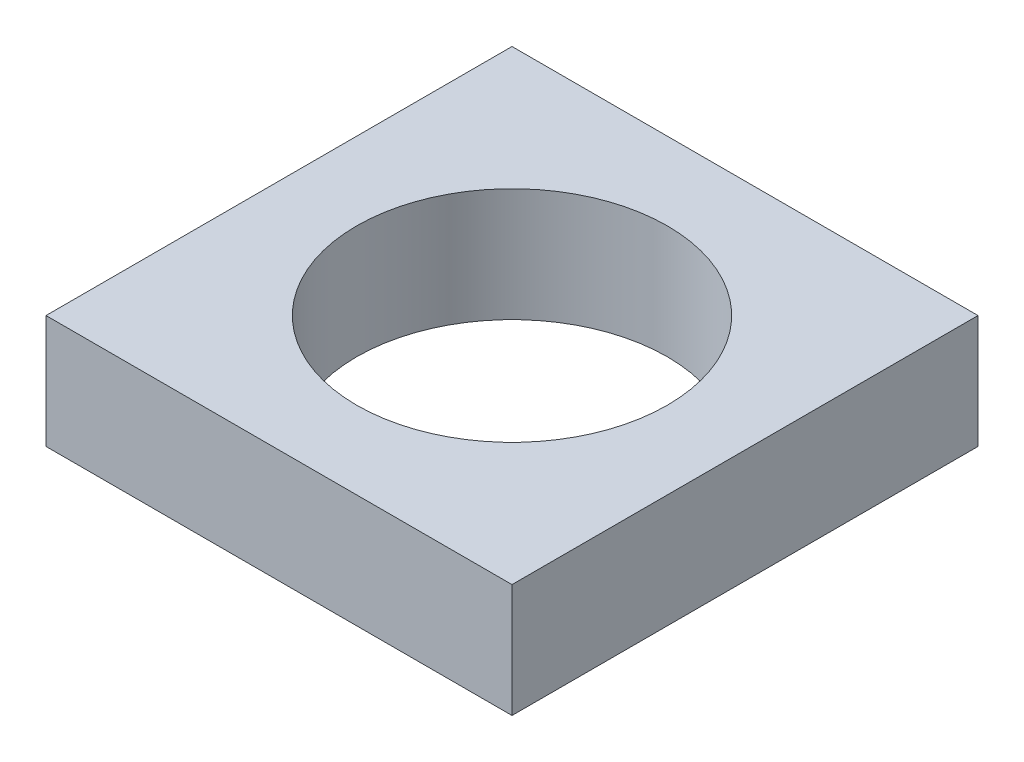
ISO-10303-21;
HEADER;
FILE_DESCRIPTION(('STEP AP214'),'2;1');
FILE_NAME('part.step','',(''),(''),'','','');
FILE_SCHEMA(('AUTOMOTIVE_DESIGN { 1 0 10303 214 1 1 1 1 }'));
ENDSEC;
DATA;
#1=APPLICATION_CONTEXT('core data for automotive mechanical design processes');
#2=APPLICATION_PROTOCOL_DEFINITION('international standard','automotive_design',2000,#1);
#3=PRODUCT_CONTEXT('',#1,'mechanical');
#4=PRODUCT('Part','Part','',(#3));
#5=PRODUCT_RELATED_PRODUCT_CATEGORY('part','',(#4));
#6=PRODUCT_DEFINITION_FORMATION('','',#4);
#7=PRODUCT_DEFINITION_CONTEXT('part definition',#1,'design');
#8=PRODUCT_DEFINITION('design','',#6,#7);
#9=PRODUCT_DEFINITION_SHAPE('','',#8);
#10=(LENGTH_UNIT() NAMED_UNIT(*) SI_UNIT(.MILLI.,.METRE.));
#11=(NAMED_UNIT(*) PLANE_ANGLE_UNIT() SI_UNIT($,.RADIAN.));
#12=(NAMED_UNIT(*) SI_UNIT($,.STERADIAN.) SOLID_ANGLE_UNIT());
#13=UNCERTAINTY_MEASURE_WITH_UNIT(LENGTH_MEASURE(1.E-05),#10,'distance_accuracy_value','');
#14=(GEOMETRIC_REPRESENTATION_CONTEXT(3) GLOBAL_UNCERTAINTY_ASSIGNED_CONTEXT((#13)) GLOBAL_UNIT_ASSIGNED_CONTEXT((#10,
#11,#12)) REPRESENTATION_CONTEXT('',''));
#15=CARTESIAN_POINT('',(0.,0.,0.));
#16=DIRECTION('',(0.,0.,1.));
#17=DIRECTION('',(1.,0.,0.));
#18=AXIS2_PLACEMENT_3D('',#15,#16,#17);
#19=CARTESIAN_POINT('',(0.,14.6,0.));
#20=DIRECTION('',(0.,-1.,0.));
#21=DIRECTION('',(0.,0.,-1.));
#22=AXIS2_PLACEMENT_3D('',#19,#20,#21);
#23=PLANE('',#22);
#24=DIRECTION('',(0.,0.,-1.));
#25=VECTOR('',#24,1.);
#26=CARTESIAN_POINT('',(30.,14.6,30.));
#27=LINE('',#26,#25);
#28=CARTESIAN_POINT('',(30.,14.6,30.));
#29=VERTEX_POINT('',#28);
#30=CARTESIAN_POINT('',(30.,14.6,-30.));
#31=VERTEX_POINT('',#30);
#32=EDGE_CURVE('E85',#29,#31,#27,.T.);
#33=ORIENTED_EDGE('',*,*,#32,.T.);
#34=DIRECTION('',(-1.,0.,0.));
#35=VECTOR('',#34,1.);
#36=CARTESIAN_POINT('',(-30.,14.6,-30.));
#37=LINE('',#36,#35);
#38=CARTESIAN_POINT('',(-30.,14.6,-30.));
#39=VERTEX_POINT('',#38);
#40=EDGE_CURVE('E80',#31,#39,#37,.T.);
#41=ORIENTED_EDGE('',*,*,#40,.T.);
#42=DIRECTION('',(0.,0.,1.));
#43=VECTOR('',#42,1.);
#44=CARTESIAN_POINT('',(-30.,14.6,30.));
#45=LINE('',#44,#43);
#46=CARTESIAN_POINT('',(-30.,14.6,30.));
#47=VERTEX_POINT('',#46);
#48=EDGE_CURVE('E83',#39,#47,#45,.T.);
#49=ORIENTED_EDGE('',*,*,#48,.T.);
#50=DIRECTION('',(1.,0.,0.));
#51=VECTOR('',#50,1.);
#52=CARTESIAN_POINT('',(-30.,14.6,30.));
#53=LINE('',#52,#51);
#54=EDGE_CURVE('E50',#47,#29,#53,.T.);
#55=ORIENTED_EDGE('',*,*,#54,.T.);
#56=EDGE_LOOP('',(#33,#41,#49,#55));
#57=FACE_BOUND('',#56,.T.);
#58=CARTESIAN_POINT('',(0.,14.6,0.));
#59=DIRECTION('',(0.,1.,0.));
#60=DIRECTION('',(0.,0.,1.));
#61=AXIS2_PLACEMENT_3D('',#58,#59,#60);
#62=CIRCLE('',#61,20.);
#63=CARTESIAN_POINT('',(0.,14.6,20.));
#64=VERTEX_POINT('',#63);
#65=EDGE_CURVE('E100',#64,#64,#62,.T.);
#66=ORIENTED_EDGE('',*,*,#65,.F.);
#67=EDGE_LOOP('',(#66));
#68=FACE_BOUND('',#67,.T.);
#69=ADVANCED_FACE('F33',(#57,#68),#23,.F.);
#70=CARTESIAN_POINT('',(0.,0.,0.));
#71=DIRECTION('',(0.,-1.,0.));
#72=DIRECTION('',(0.,0.,-1.));
#73=AXIS2_PLACEMENT_3D('',#70,#71,#72);
#74=PLANE('',#73);
#75=DIRECTION('',(0.,0.,-1.));
#76=VECTOR('',#75,1.);
#77=CARTESIAN_POINT('',(30.,0.,30.));
#78=LINE('',#77,#76);
#79=CARTESIAN_POINT('',(30.,0.,30.));
#80=VERTEX_POINT('',#79);
#81=CARTESIAN_POINT('',(30.,0.,-30.));
#82=VERTEX_POINT('',#81);
#83=EDGE_CURVE('E97',#80,#82,#78,.T.);
#84=ORIENTED_EDGE('',*,*,#83,.F.);
#85=DIRECTION('',(1.,0.,0.));
#86=VECTOR('',#85,1.);
#87=CARTESIAN_POINT('',(-30.,0.,30.));
#88=LINE('',#87,#86);
#89=CARTESIAN_POINT('',(-30.,0.,30.));
#90=VERTEX_POINT('',#89);
#91=EDGE_CURVE('E73',#90,#80,#88,.T.);
#92=ORIENTED_EDGE('',*,*,#91,.F.);
#93=DIRECTION('',(0.,0.,1.));
#94=VECTOR('',#93,1.);
#95=CARTESIAN_POINT('',(-30.,0.,30.));
#96=LINE('',#95,#94);
#97=CARTESIAN_POINT('',(-30.,0.,-30.));
#98=VERTEX_POINT('',#97);
#99=EDGE_CURVE('E67',#98,#90,#96,.T.);
#100=ORIENTED_EDGE('',*,*,#99,.F.);
#101=DIRECTION('',(-1.,0.,0.));
#102=VECTOR('',#101,1.);
#103=CARTESIAN_POINT('',(-30.,0.,-30.));
#104=LINE('',#103,#102);
#105=EDGE_CURVE('E89',#82,#98,#104,.T.);
#106=ORIENTED_EDGE('',*,*,#105,.F.);
#107=EDGE_LOOP('',(#84,#92,#100,#106));
#108=FACE_BOUND('',#107,.T.);
#109=CARTESIAN_POINT('',(0.,0.,0.));
#110=DIRECTION('',(0.,1.,0.));
#111=DIRECTION('',(0.,0.,1.));
#112=AXIS2_PLACEMENT_3D('',#109,#110,#111);
#113=CIRCLE('',#112,20.);
#114=CARTESIAN_POINT('',(0.,0.,20.));
#115=VERTEX_POINT('',#114);
#116=EDGE_CURVE('E112',#115,#115,#113,.T.);
#117=ORIENTED_EDGE('',*,*,#116,.T.);
#118=EDGE_LOOP('',(#117));
#119=FACE_BOUND('',#118,.T.);
#120=ADVANCED_FACE('F108',(#108,#119),#74,.T.);
#121=CARTESIAN_POINT('',(30.,14.6,30.));
#122=DIRECTION('',(-1.,0.,0.));
#123=DIRECTION('',(0.,0.,1.));
#124=AXIS2_PLACEMENT_3D('',#121,#122,#123);
#125=PLANE('',#124);
#126=ORIENTED_EDGE('',*,*,#83,.T.);
#127=DIRECTION('',(0.,-1.,0.));
#128=VECTOR('',#127,1.);
#129=CARTESIAN_POINT('',(30.,14.6,-30.));
#130=LINE('',#129,#128);
#131=EDGE_CURVE('E11',#31,#82,#130,.T.);
#132=ORIENTED_EDGE('',*,*,#131,.F.);
#133=ORIENTED_EDGE('',*,*,#32,.F.);
#134=DIRECTION('',(0.,-1.,0.));
#135=VECTOR('',#134,1.);
#136=CARTESIAN_POINT('',(30.,14.6,30.));
#137=LINE('',#136,#135);
#138=EDGE_CURVE('E93',#29,#80,#137,.T.);
#139=ORIENTED_EDGE('',*,*,#138,.T.);
#140=EDGE_LOOP('',(#126,#132,#133,#139));
#141=FACE_BOUND('',#140,.T.);
#142=ADVANCED_FACE('F35',(#141),#125,.F.);
#143=CARTESIAN_POINT('',(-30.,14.6,-30.));
#144=DIRECTION('',(0.,0.,1.));
#145=DIRECTION('',(1.,0.,0.));
#146=AXIS2_PLACEMENT_3D('',#143,#144,#145);
#147=PLANE('',#146);
#148=ORIENTED_EDGE('',*,*,#105,.T.);
#149=DIRECTION('',(0.,-1.,0.));
#150=VECTOR('',#149,1.);
#151=CARTESIAN_POINT('',(-30.,14.6,-30.));
#152=LINE('',#151,#150);
#153=EDGE_CURVE('E42',#39,#98,#152,.T.);
#154=ORIENTED_EDGE('',*,*,#153,.F.);
#155=ORIENTED_EDGE('',*,*,#40,.F.);
#156=ORIENTED_EDGE('',*,*,#131,.T.);
#157=EDGE_LOOP('',(#148,#154,#155,#156));
#158=FACE_BOUND('',#157,.T.);
#159=ADVANCED_FACE('F88',(#158),#147,.F.);
#160=CARTESIAN_POINT('',(-30.,14.6,30.));
#161=DIRECTION('',(1.,0.,0.));
#162=DIRECTION('',(0.,0.,-1.));
#163=AXIS2_PLACEMENT_3D('',#160,#161,#162);
#164=PLANE('',#163);
#165=ORIENTED_EDGE('',*,*,#99,.T.);
#166=DIRECTION('',(0.,-1.,0.));
#167=VECTOR('',#166,1.);
#168=CARTESIAN_POINT('',(-30.,14.6,30.));
#169=LINE('',#168,#167);
#170=EDGE_CURVE('E90',#47,#90,#169,.T.);
#171=ORIENTED_EDGE('',*,*,#170,.F.);
#172=ORIENTED_EDGE('',*,*,#48,.F.);
#173=ORIENTED_EDGE('',*,*,#153,.T.);
#174=EDGE_LOOP('',(#165,#171,#172,#173));
#175=FACE_BOUND('',#174,.T.);
#176=ADVANCED_FACE('F91',(#175),#164,.F.);
#177=CARTESIAN_POINT('',(-30.,14.6,30.));
#178=DIRECTION('',(0.,0.,-1.));
#179=DIRECTION('',(-1.,0.,0.));
#180=AXIS2_PLACEMENT_3D('',#177,#178,#179);
#181=PLANE('',#180);
#182=ORIENTED_EDGE('',*,*,#91,.T.);
#183=ORIENTED_EDGE('',*,*,#138,.F.);
#184=ORIENTED_EDGE('',*,*,#54,.F.);
#185=ORIENTED_EDGE('',*,*,#170,.T.);
#186=EDGE_LOOP('',(#182,#183,#184,#185));
#187=FACE_BOUND('',#186,.T.);
#188=ADVANCED_FACE('F105',(#187),#181,.F.);
#189=CARTESIAN_POINT('',(0.,14.6,0.));
#190=DIRECTION('',(0.,-1.,0.));
#191=DIRECTION('',(0.,0.,-1.));
#192=AXIS2_PLACEMENT_3D('',#189,#190,#191);
#193=CYLINDRICAL_SURFACE('',#192,20.);
#194=ORIENTED_EDGE('',*,*,#65,.T.);
#195=EDGE_LOOP('',(#194));
#196=FACE_BOUND('',#195,.T.);
#197=ORIENTED_EDGE('',*,*,#116,.F.);
#198=EDGE_LOOP('',(#197));
#199=FACE_BOUND('',#198,.T.);
#200=ADVANCED_FACE('F118',(#196,#199),#193,.F.);
#201=CLOSED_SHELL('',(#69,#120,#142,#159,#176,#188,#200));
#202=MANIFOLD_SOLID_BREP('B2',#201);
#203=ADVANCED_BREP_SHAPE_REPRESENTATION('',(#18,#202),#14);
#204=SHAPE_DEFINITION_REPRESENTATION(#9,#203);
ENDSEC;
END-ISO-10303-21;
